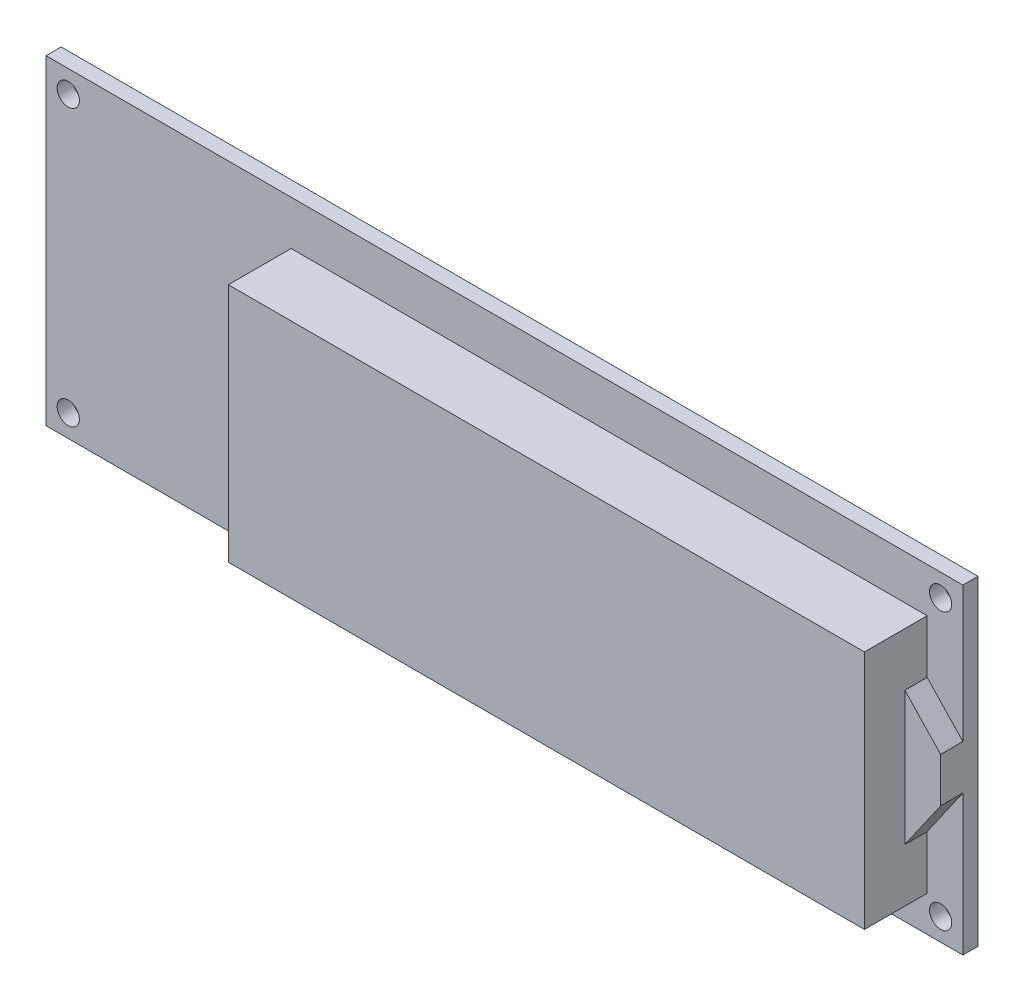
ISO-10303-21;
HEADER;
FILE_DESCRIPTION(('STEP AP214'),'2;1');
FILE_NAME('part.step','',(''),(''),'','','');
FILE_SCHEMA(('AUTOMOTIVE_DESIGN { 1 0 10303 214 1 1 1 1 }'));
ENDSEC;
DATA;
#1=APPLICATION_CONTEXT('core data for automotive mechanical design processes');
#2=APPLICATION_PROTOCOL_DEFINITION('international standard','automotive_design',2000,#1);
#3=PRODUCT_CONTEXT('',#1,'mechanical');
#4=PRODUCT('Part','Part','',(#3));
#5=PRODUCT_RELATED_PRODUCT_CATEGORY('part','',(#4));
#6=PRODUCT_DEFINITION_FORMATION('','',#4);
#7=PRODUCT_DEFINITION_CONTEXT('part definition',#1,'design');
#8=PRODUCT_DEFINITION('design','',#6,#7);
#9=PRODUCT_DEFINITION_SHAPE('','',#8);
#10=(LENGTH_UNIT() NAMED_UNIT(*) SI_UNIT(.MILLI.,.METRE.));
#11=(NAMED_UNIT(*) PLANE_ANGLE_UNIT() SI_UNIT($,.RADIAN.));
#12=(NAMED_UNIT(*) SI_UNIT($,.STERADIAN.) SOLID_ANGLE_UNIT());
#13=UNCERTAINTY_MEASURE_WITH_UNIT(LENGTH_MEASURE(1.E-05),#10,'distance_accuracy_value','');
#14=(GEOMETRIC_REPRESENTATION_CONTEXT(3) GLOBAL_UNCERTAINTY_ASSIGNED_CONTEXT((#13)) GLOBAL_UNIT_ASSIGNED_CONTEXT((#10,
#11,#12)) REPRESENTATION_CONTEXT('',''));
#15=CARTESIAN_POINT('',(0.,0.,0.));
#16=DIRECTION('',(0.,0.,1.));
#17=DIRECTION('',(1.,0.,0.));
#18=AXIS2_PLACEMENT_3D('',#15,#16,#17);
#19=CARTESIAN_POINT('',(0.,0.,1.7));
#20=DIRECTION('',(0.,0.,1.));
#21=DIRECTION('',(1.,0.,0.));
#22=AXIS2_PLACEMENT_3D('',#19,#20,#21);
#23=PLANE('',#22);
#24=CARTESIAN_POINT('',(-49.,15.5,1.7));
#25=DIRECTION('',(0.,0.,1.));
#26=DIRECTION('',(1.,0.,0.));
#27=AXIS2_PLACEMENT_3D('',#24,#25,#26);
#28=CIRCLE('',#27,1.25);
#29=CARTESIAN_POINT('',(-47.75,15.5,1.7));
#30=VERTEX_POINT('',#29);
#31=EDGE_CURVE('E171',#30,#30,#28,.T.);
#32=ORIENTED_EDGE('',*,*,#31,.F.);
#33=EDGE_LOOP('',(#32));
#34=FACE_BOUND('',#33,.T.);
#35=CARTESIAN_POINT('',(-49.,-15.5,1.7));
#36=DIRECTION('',(0.,0.,1.));
#37=DIRECTION('',(1.,0.,0.));
#38=AXIS2_PLACEMENT_3D('',#35,#36,#37);
#39=CIRCLE('',#38,1.25000000000001);
#40=CARTESIAN_POINT('',(-47.75,-15.5,1.7));
#41=VERTEX_POINT('',#40);
#42=EDGE_CURVE('E167',#41,#41,#39,.T.);
#43=ORIENTED_EDGE('',*,*,#42,.F.);
#44=EDGE_LOOP('',(#43));
#45=FACE_BOUND('',#44,.T.);
#46=CARTESIAN_POINT('',(49.,15.5,1.7));
#47=DIRECTION('',(0.,0.,1.));
#48=DIRECTION('',(1.,0.,0.));
#49=AXIS2_PLACEMENT_3D('',#46,#47,#48);
#50=CIRCLE('',#49,1.25);
#51=CARTESIAN_POINT('',(50.25,15.5,1.7));
#52=VERTEX_POINT('',#51);
#53=EDGE_CURVE('E163',#52,#52,#50,.T.);
#54=ORIENTED_EDGE('',*,*,#53,.F.);
#55=EDGE_LOOP('',(#54));
#56=FACE_BOUND('',#55,.T.);
#57=CARTESIAN_POINT('',(49.,-15.5,1.7));
#58=DIRECTION('',(0.,0.,1.));
#59=DIRECTION('',(1.,0.,0.));
#60=AXIS2_PLACEMENT_3D('',#57,#58,#59);
#61=CIRCLE('',#60,1.25);
#62=CARTESIAN_POINT('',(50.25,-15.5,1.7));
#63=VERTEX_POINT('',#62);
#64=EDGE_CURVE('E133',#63,#63,#61,.T.);
#65=ORIENTED_EDGE('',*,*,#64,.F.);
#66=EDGE_LOOP('',(#65));
#67=FACE_BOUND('',#66,.T.);
#68=DIRECTION('',(0.,1.,0.));
#69=VECTOR('',#68,1.);
#70=CARTESIAN_POINT('',(51.5,18.,1.7));
#71=LINE('',#70,#69);
#72=CARTESIAN_POINT('',(51.5,-18.,1.7));
#73=VERTEX_POINT('',#72);
#74=CARTESIAN_POINT('',(51.5,-2.2341970089883,1.7));
#75=VERTEX_POINT('',#74);
#76=EDGE_CURVE('E56',#73,#75,#71,.T.);
#77=ORIENTED_EDGE('',*,*,#76,.T.);
#78=DIRECTION('',(0.571637193839568,0.820506501265666,0.));
#79=VECTOR('',#78,1.);
#80=CARTESIAN_POINT('',(47.49,-7.99,1.7));
#81=LINE('',#80,#79);
#82=CARTESIAN_POINT('',(47.49,-7.99,1.7));
#83=VERTEX_POINT('',#82);
#84=EDGE_CURVE('E149',#83,#75,#81,.T.);
#85=ORIENTED_EDGE('',*,*,#84,.F.);
#86=DIRECTION('',(0.,1.,0.));
#87=VECTOR('',#86,1.);
#88=CARTESIAN_POINT('',(47.49,13.01,1.7));
#89=LINE('',#88,#87);
#90=CARTESIAN_POINT('',(47.49,-13.99,1.7));
#91=VERTEX_POINT('',#90);
#92=EDGE_CURVE('E131',#91,#83,#89,.T.);
#93=ORIENTED_EDGE('',*,*,#92,.F.);
#94=DIRECTION('',(1.,0.,0.));
#95=VECTOR('',#94,1.);
#96=CARTESIAN_POINT('',(-23.96,-13.99,1.7));
#97=LINE('',#96,#95);
#98=CARTESIAN_POINT('',(-23.96,-13.99,1.7));
#99=VERTEX_POINT('',#98);
#100=EDGE_CURVE('E179',#99,#91,#97,.T.);
#101=ORIENTED_EDGE('',*,*,#100,.F.);
#102=DIRECTION('',(0.,-1.,0.));
#103=VECTOR('',#102,1.);
#104=CARTESIAN_POINT('',(-23.96,13.01,1.7));
#105=LINE('',#104,#103);
#106=CARTESIAN_POINT('',(-23.96,13.01,1.7));
#107=VERTEX_POINT('',#106);
#108=EDGE_CURVE('E190',#107,#99,#105,.T.);
#109=ORIENTED_EDGE('',*,*,#108,.F.);
#110=DIRECTION('',(-1.,0.,0.));
#111=VECTOR('',#110,1.);
#112=CARTESIAN_POINT('',(-23.96,13.01,1.7));
#113=LINE('',#112,#111);
#114=CARTESIAN_POINT('',(47.49,13.01,1.7));
#115=VERTEX_POINT('',#114);
#116=EDGE_CURVE('E187',#115,#107,#113,.T.);
#117=ORIENTED_EDGE('',*,*,#116,.F.);
#118=CARTESIAN_POINT('',(47.49,7.01,1.7));
#119=VERTEX_POINT('',#118);
#120=EDGE_CURVE('E188',#119,#115,#89,.T.);
#121=ORIENTED_EDGE('',*,*,#120,.F.);
#122=DIRECTION('',(-0.687623133097345,0.726067783908218,0.));
#123=VECTOR('',#122,1.);
#124=CARTESIAN_POINT('',(47.49,7.01,1.7));
#125=LINE('',#124,#123);
#126=CARTESIAN_POINT('',(51.5,2.77580299101169,1.7));
#127=VERTEX_POINT('',#126);
#128=EDGE_CURVE('E49',#127,#119,#125,.T.);
#129=ORIENTED_EDGE('',*,*,#128,.F.);
#130=CARTESIAN_POINT('',(51.5,18.,1.7));
#131=VERTEX_POINT('',#130);
#132=EDGE_CURVE('E206',#127,#131,#71,.T.);
#133=ORIENTED_EDGE('',*,*,#132,.T.);
#134=DIRECTION('',(-1.,0.,0.));
#135=VECTOR('',#134,1.);
#136=CARTESIAN_POINT('',(-51.5,18.,1.7));
#137=LINE('',#136,#135);
#138=CARTESIAN_POINT('',(-51.5,18.,1.7));
#139=VERTEX_POINT('',#138);
#140=EDGE_CURVE('E205',#131,#139,#137,.T.);
#141=ORIENTED_EDGE('',*,*,#140,.T.);
#142=DIRECTION('',(0.,-1.,0.));
#143=VECTOR('',#142,1.);
#144=CARTESIAN_POINT('',(-51.5,18.,1.7));
#145=LINE('',#144,#143);
#146=CARTESIAN_POINT('',(-51.5,-18.,1.7));
#147=VERTEX_POINT('',#146);
#148=EDGE_CURVE('E208',#139,#147,#145,.T.);
#149=ORIENTED_EDGE('',*,*,#148,.T.);
#150=DIRECTION('',(1.,0.,0.));
#151=VECTOR('',#150,1.);
#152=CARTESIAN_POINT('',(-51.5,-18.,1.7));
#153=LINE('',#152,#151);
#154=EDGE_CURVE('E210',#147,#73,#153,.T.);
#155=ORIENTED_EDGE('',*,*,#154,.T.);
#156=EDGE_LOOP('',(#77,#85,#93,#101,#109,#117,#121,#129,#133,#141,#149,#155));
#157=FACE_BOUND('',#156,.T.);
#158=ADVANCED_FACE('F32',(#34,#45,#56,#67,#157),#23,.T.);
#159=CARTESIAN_POINT('',(47.49,13.01,8.75));
#160=DIRECTION('',(-1.,0.,0.));
#161=DIRECTION('',(0.,0.,1.));
#162=AXIS2_PLACEMENT_3D('',#159,#160,#161);
#163=PLANE('',#162);
#164=DIRECTION('',(0.,0.,-1.));
#165=VECTOR('',#164,1.);
#166=CARTESIAN_POINT('',(47.49,-7.99,4.2));
#167=LINE('',#166,#165);
#168=CARTESIAN_POINT('',(47.49,-7.99,4.2));
#169=VERTEX_POINT('',#168);
#170=EDGE_CURVE('E123',#169,#83,#167,.T.);
#171=ORIENTED_EDGE('',*,*,#170,.F.);
#172=DIRECTION('',(0.,-1.,0.));
#173=VECTOR('',#172,1.);
#174=CARTESIAN_POINT('',(47.49,-7.99,4.2));
#175=LINE('',#174,#173);
#176=CARTESIAN_POINT('',(47.49,7.01,4.2));
#177=VERTEX_POINT('',#176);
#178=EDGE_CURVE('E127',#177,#169,#175,.T.);
#179=ORIENTED_EDGE('',*,*,#178,.F.);
#180=DIRECTION('',(0.,0.,-1.));
#181=VECTOR('',#180,1.);
#182=CARTESIAN_POINT('',(47.49,7.01,4.2));
#183=LINE('',#182,#181);
#184=EDGE_CURVE('E154',#177,#119,#183,.T.);
#185=ORIENTED_EDGE('',*,*,#184,.T.);
#186=ORIENTED_EDGE('',*,*,#120,.T.);
#187=DIRECTION('',(0.,0.,-1.));
#188=VECTOR('',#187,1.);
#189=CARTESIAN_POINT('',(47.49,13.01,8.75));
#190=LINE('',#189,#188);
#191=CARTESIAN_POINT('',(47.49,13.01,8.75));
#192=VERTEX_POINT('',#191);
#193=EDGE_CURVE('E200',#192,#115,#190,.T.);
#194=ORIENTED_EDGE('',*,*,#193,.F.);
#195=DIRECTION('',(0.,1.,0.));
#196=VECTOR('',#195,1.);
#197=CARTESIAN_POINT('',(47.49,13.01,8.75));
#198=LINE('',#197,#196);
#199=CARTESIAN_POINT('',(47.49,-13.99,8.75));
#200=VERTEX_POINT('',#199);
#201=EDGE_CURVE('E175',#200,#192,#198,.T.);
#202=ORIENTED_EDGE('',*,*,#201,.F.);
#203=DIRECTION('',(0.,0.,-1.));
#204=VECTOR('',#203,1.);
#205=CARTESIAN_POINT('',(47.49,-13.99,8.75));
#206=LINE('',#205,#204);
#207=EDGE_CURVE('E185',#200,#91,#206,.T.);
#208=ORIENTED_EDGE('',*,*,#207,.T.);
#209=ORIENTED_EDGE('',*,*,#92,.T.);
#210=EDGE_LOOP('',(#171,#179,#185,#186,#194,#202,#208,#209));
#211=FACE_BOUND('',#210,.T.);
#212=ADVANCED_FACE('F125',(#211),#163,.F.);
#213=CARTESIAN_POINT('',(51.5,18.,1.7));
#214=DIRECTION('',(-1.,0.,0.));
#215=DIRECTION('',(0.,-1.,0.));
#216=AXIS2_PLACEMENT_3D('',#213,#214,#215);
#217=PLANE('',#216);
#218=DIRECTION('',(0.,1.,0.));
#219=VECTOR('',#218,1.);
#220=CARTESIAN_POINT('',(51.5,18.,0.));
#221=LINE('',#220,#219);
#222=CARTESIAN_POINT('',(51.5,-18.,0.));
#223=VERTEX_POINT('',#222);
#224=CARTESIAN_POINT('',(51.5,18.,0.));
#225=VERTEX_POINT('',#224);
#226=EDGE_CURVE('E203',#223,#225,#221,.T.);
#227=ORIENTED_EDGE('',*,*,#226,.T.);
#228=DIRECTION('',(0.,0.,-1.));
#229=VECTOR('',#228,1.);
#230=CARTESIAN_POINT('',(51.5,18.,1.7));
#231=LINE('',#230,#229);
#232=EDGE_CURVE('E11',#131,#225,#231,.T.);
#233=ORIENTED_EDGE('',*,*,#232,.F.);
#234=ORIENTED_EDGE('',*,*,#132,.F.);
#235=DIRECTION('',(0.,0.,-1.));
#236=VECTOR('',#235,1.);
#237=CARTESIAN_POINT('',(51.5,2.7758029910117,4.2));
#238=LINE('',#237,#236);
#239=CARTESIAN_POINT('',(51.5,2.7758029910117,4.2));
#240=VERTEX_POINT('',#239);
#241=EDGE_CURVE('E157',#240,#127,#238,.T.);
#242=ORIENTED_EDGE('',*,*,#241,.F.);
#243=DIRECTION('',(0.,1.,0.));
#244=VECTOR('',#243,1.);
#245=CARTESIAN_POINT('',(51.5,-2.2341970089883,4.2));
#246=LINE('',#245,#244);
#247=CARTESIAN_POINT('',(51.5,-2.2341970089883,4.2));
#248=VERTEX_POINT('',#247);
#249=EDGE_CURVE('E142',#248,#240,#246,.T.);
#250=ORIENTED_EDGE('',*,*,#249,.F.);
#251=DIRECTION('',(0.,0.,-1.));
#252=VECTOR('',#251,1.);
#253=CARTESIAN_POINT('',(51.5,-2.2341970089883,4.2));
#254=LINE('',#253,#252);
#255=EDGE_CURVE('E134',#248,#75,#254,.T.);
#256=ORIENTED_EDGE('',*,*,#255,.T.);
#257=ORIENTED_EDGE('',*,*,#76,.F.);
#258=DIRECTION('',(0.,0.,-1.));
#259=VECTOR('',#258,1.);
#260=CARTESIAN_POINT('',(51.5,-18.,1.7));
#261=LINE('',#260,#259);
#262=EDGE_CURVE('E212',#73,#223,#261,.T.);
#263=ORIENTED_EDGE('',*,*,#262,.T.);
#264=EDGE_LOOP('',(#227,#233,#234,#242,#250,#256,#257,#263));
#265=FACE_BOUND('',#264,.T.);
#266=ADVANCED_FACE('F34',(#265),#217,.F.);
#267=CARTESIAN_POINT('',(-51.5,18.,1.7));
#268=DIRECTION('',(0.,-1.,0.));
#269=DIRECTION('',(0.,0.,-1.));
#270=AXIS2_PLACEMENT_3D('',#267,#268,#269);
#271=PLANE('',#270);
#272=DIRECTION('',(-1.,0.,0.));
#273=VECTOR('',#272,1.);
#274=CARTESIAN_POINT('',(-51.5,18.,0.));
#275=LINE('',#274,#273);
#276=CARTESIAN_POINT('',(-51.5,18.,0.));
#277=VERTEX_POINT('',#276);
#278=EDGE_CURVE('E215',#225,#277,#275,.T.);
#279=ORIENTED_EDGE('',*,*,#278,.T.);
#280=DIRECTION('',(0.,0.,-1.));
#281=VECTOR('',#280,1.);
#282=CARTESIAN_POINT('',(-51.5,18.,1.7));
#283=LINE('',#282,#281);
#284=EDGE_CURVE('E41',#139,#277,#283,.T.);
#285=ORIENTED_EDGE('',*,*,#284,.F.);
#286=ORIENTED_EDGE('',*,*,#140,.F.);
#287=ORIENTED_EDGE('',*,*,#232,.T.);
#288=EDGE_LOOP('',(#279,#285,#286,#287));
#289=FACE_BOUND('',#288,.T.);
#290=ADVANCED_FACE('F273',(#289),#271,.F.);
#291=CARTESIAN_POINT('',(-51.5,18.,1.7));
#292=DIRECTION('',(1.,0.,0.));
#293=DIRECTION('',(0.,1.,0.));
#294=AXIS2_PLACEMENT_3D('',#291,#292,#293);
#295=PLANE('',#294);
#296=DIRECTION('',(0.,-1.,0.));
#297=VECTOR('',#296,1.);
#298=CARTESIAN_POINT('',(-51.5,18.,0.));
#299=LINE('',#298,#297);
#300=CARTESIAN_POINT('',(-51.5,-18.,0.));
#301=VERTEX_POINT('',#300);
#302=EDGE_CURVE('E217',#277,#301,#299,.T.);
#303=ORIENTED_EDGE('',*,*,#302,.T.);
#304=DIRECTION('',(0.,0.,-1.));
#305=VECTOR('',#304,1.);
#306=CARTESIAN_POINT('',(-51.5,-18.,1.7));
#307=LINE('',#306,#305);
#308=EDGE_CURVE('E223',#147,#301,#307,.T.);
#309=ORIENTED_EDGE('',*,*,#308,.F.);
#310=ORIENTED_EDGE('',*,*,#148,.F.);
#311=ORIENTED_EDGE('',*,*,#284,.T.);
#312=EDGE_LOOP('',(#303,#309,#310,#311));
#313=FACE_BOUND('',#312,.T.);
#314=ADVANCED_FACE('F270',(#313),#295,.F.);
#315=CARTESIAN_POINT('',(-51.5,-18.,1.7));
#316=DIRECTION('',(0.,1.,0.));
#317=DIRECTION('',(0.,0.,1.));
#318=AXIS2_PLACEMENT_3D('',#315,#316,#317);
#319=PLANE('',#318);
#320=DIRECTION('',(1.,0.,0.));
#321=VECTOR('',#320,1.);
#322=CARTESIAN_POINT('',(-51.5,-18.,0.));
#323=LINE('',#322,#321);
#324=EDGE_CURVE('E219',#301,#223,#323,.T.);
#325=ORIENTED_EDGE('',*,*,#324,.T.);
#326=ORIENTED_EDGE('',*,*,#262,.F.);
#327=ORIENTED_EDGE('',*,*,#154,.F.);
#328=ORIENTED_EDGE('',*,*,#308,.T.);
#329=EDGE_LOOP('',(#325,#326,#327,#328));
#330=FACE_BOUND('',#329,.T.);
#331=ADVANCED_FACE('F266',(#330),#319,.F.);
#332=CARTESIAN_POINT('',(0.,0.,0.));
#333=DIRECTION('',(0.,0.,1.));
#334=DIRECTION('',(1.,0.,0.));
#335=AXIS2_PLACEMENT_3D('',#332,#333,#334);
#336=PLANE('',#335);
#337=CARTESIAN_POINT('',(49.,-15.5,0.));
#338=DIRECTION('',(0.,0.,1.));
#339=DIRECTION('',(1.,0.,0.));
#340=AXIS2_PLACEMENT_3D('',#337,#338,#339);
#341=CIRCLE('',#340,1.25);
#342=CARTESIAN_POINT('',(50.25,-15.5,0.));
#343=VERTEX_POINT('',#342);
#344=EDGE_CURVE('E36',#343,#343,#341,.T.);
#345=ORIENTED_EDGE('',*,*,#344,.T.);
#346=EDGE_LOOP('',(#345));
#347=FACE_BOUND('',#346,.T.);
#348=CARTESIAN_POINT('',(49.,15.5,0.));
#349=DIRECTION('',(0.,0.,1.));
#350=DIRECTION('',(1.,0.,0.));
#351=AXIS2_PLACEMENT_3D('',#348,#349,#350);
#352=CIRCLE('',#351,1.25);
#353=CARTESIAN_POINT('',(50.25,15.5,0.));
#354=VERTEX_POINT('',#353);
#355=EDGE_CURVE('E166',#354,#354,#352,.T.);
#356=ORIENTED_EDGE('',*,*,#355,.T.);
#357=EDGE_LOOP('',(#356));
#358=FACE_BOUND('',#357,.T.);
#359=CARTESIAN_POINT('',(-49.,-15.5,0.));
#360=DIRECTION('',(0.,0.,1.));
#361=DIRECTION('',(1.,0.,0.));
#362=AXIS2_PLACEMENT_3D('',#359,#360,#361);
#363=CIRCLE('',#362,1.25000000000001);
#364=CARTESIAN_POINT('',(-47.75,-15.5,0.));
#365=VERTEX_POINT('',#364);
#366=EDGE_CURVE('E170',#365,#365,#363,.T.);
#367=ORIENTED_EDGE('',*,*,#366,.T.);
#368=EDGE_LOOP('',(#367));
#369=FACE_BOUND('',#368,.T.);
#370=CARTESIAN_POINT('',(-49.,15.5,0.));
#371=DIRECTION('',(0.,0.,1.));
#372=DIRECTION('',(1.,0.,0.));
#373=AXIS2_PLACEMENT_3D('',#370,#371,#372);
#374=CIRCLE('',#373,1.25);
#375=CARTESIAN_POINT('',(-47.75,15.5,0.));
#376=VERTEX_POINT('',#375);
#377=EDGE_CURVE('E174',#376,#376,#374,.T.);
#378=ORIENTED_EDGE('',*,*,#377,.T.);
#379=EDGE_LOOP('',(#378));
#380=FACE_BOUND('',#379,.T.);
#381=ORIENTED_EDGE('',*,*,#226,.F.);
#382=ORIENTED_EDGE('',*,*,#324,.F.);
#383=ORIENTED_EDGE('',*,*,#302,.F.);
#384=ORIENTED_EDGE('',*,*,#278,.F.);
#385=EDGE_LOOP('',(#381,#382,#383,#384));
#386=FACE_BOUND('',#385,.T.);
#387=ADVANCED_FACE('F234',(#347,#358,#369,#380,#386),#336,.F.);
#388=CARTESIAN_POINT('',(-23.96,13.01,8.75));
#389=DIRECTION('',(0.,-1.,0.));
#390=DIRECTION('',(1.,0.,0.));
#391=AXIS2_PLACEMENT_3D('',#388,#389,#390);
#392=PLANE('',#391);
#393=ORIENTED_EDGE('',*,*,#116,.T.);
#394=DIRECTION('',(0.,0.,-1.));
#395=VECTOR('',#394,1.);
#396=CARTESIAN_POINT('',(-23.96,13.01,8.75));
#397=LINE('',#396,#395);
#398=CARTESIAN_POINT('',(-23.96,13.01,8.75));
#399=VERTEX_POINT('',#398);
#400=EDGE_CURVE('E197',#399,#107,#397,.T.);
#401=ORIENTED_EDGE('',*,*,#400,.F.);
#402=DIRECTION('',(-1.,0.,0.));
#403=VECTOR('',#402,1.);
#404=CARTESIAN_POINT('',(-23.96,13.01,8.75));
#405=LINE('',#404,#403);
#406=EDGE_CURVE('E178',#192,#399,#405,.T.);
#407=ORIENTED_EDGE('',*,*,#406,.F.);
#408=ORIENTED_EDGE('',*,*,#193,.T.);
#409=EDGE_LOOP('',(#393,#401,#407,#408));
#410=FACE_BOUND('',#409,.T.);
#411=ADVANCED_FACE('F265',(#410),#392,.F.);
#412=CARTESIAN_POINT('',(-23.96,13.01,8.75));
#413=DIRECTION('',(1.,0.,0.));
#414=DIRECTION('',(0.,0.,-1.));
#415=AXIS2_PLACEMENT_3D('',#412,#413,#414);
#416=PLANE('',#415);
#417=ORIENTED_EDGE('',*,*,#108,.T.);
#418=DIRECTION('',(0.,0.,-1.));
#419=VECTOR('',#418,1.);
#420=CARTESIAN_POINT('',(-23.96,-13.99,8.75));
#421=LINE('',#420,#419);
#422=CARTESIAN_POINT('',(-23.96,-13.99,8.75));
#423=VERTEX_POINT('',#422);
#424=EDGE_CURVE('E195',#423,#99,#421,.T.);
#425=ORIENTED_EDGE('',*,*,#424,.F.);
#426=DIRECTION('',(0.,-1.,0.));
#427=VECTOR('',#426,1.);
#428=CARTESIAN_POINT('',(-23.96,13.01,8.75));
#429=LINE('',#428,#427);
#430=EDGE_CURVE('E181',#399,#423,#429,.T.);
#431=ORIENTED_EDGE('',*,*,#430,.F.);
#432=ORIENTED_EDGE('',*,*,#400,.T.);
#433=EDGE_LOOP('',(#417,#425,#431,#432));
#434=FACE_BOUND('',#433,.T.);
#435=ADVANCED_FACE('F303',(#434),#416,.F.);
#436=CARTESIAN_POINT('',(-23.96,-13.99,8.75));
#437=DIRECTION('',(0.,1.,0.));
#438=DIRECTION('',(0.,0.,1.));
#439=AXIS2_PLACEMENT_3D('',#436,#437,#438);
#440=PLANE('',#439);
#441=ORIENTED_EDGE('',*,*,#100,.T.);
#442=ORIENTED_EDGE('',*,*,#207,.F.);
#443=DIRECTION('',(1.,0.,0.));
#444=VECTOR('',#443,1.);
#445=CARTESIAN_POINT('',(-23.96,-13.99,8.75));
#446=LINE('',#445,#444);
#447=EDGE_CURVE('E183',#423,#200,#446,.T.);
#448=ORIENTED_EDGE('',*,*,#447,.F.);
#449=ORIENTED_EDGE('',*,*,#424,.T.);
#450=EDGE_LOOP('',(#441,#442,#448,#449));
#451=FACE_BOUND('',#450,.T.);
#452=ADVANCED_FACE('F311',(#451),#440,.F.);
#453=CARTESIAN_POINT('',(0.,0.,8.75));
#454=DIRECTION('',(0.,0.,1.));
#455=DIRECTION('',(1.,0.,0.));
#456=AXIS2_PLACEMENT_3D('',#453,#454,#455);
#457=PLANE('',#456);
#458=ORIENTED_EDGE('',*,*,#201,.T.);
#459=ORIENTED_EDGE('',*,*,#406,.T.);
#460=ORIENTED_EDGE('',*,*,#430,.T.);
#461=ORIENTED_EDGE('',*,*,#447,.T.);
#462=EDGE_LOOP('',(#458,#459,#460,#461));
#463=FACE_BOUND('',#462,.T.);
#464=ADVANCED_FACE('F307',(#463),#457,.T.);
#465=CARTESIAN_POINT('',(-49.,15.5,-4.3));
#466=DIRECTION('',(0.,0.,1.));
#467=DIRECTION('',(1.,0.,0.));
#468=AXIS2_PLACEMENT_3D('',#465,#466,#467);
#469=CYLINDRICAL_SURFACE('',#468,1.25);
#470=ORIENTED_EDGE('',*,*,#31,.T.);
#471=EDGE_LOOP('',(#470));
#472=FACE_BOUND('',#471,.T.);
#473=ORIENTED_EDGE('',*,*,#377,.F.);
#474=EDGE_LOOP('',(#473));
#475=FACE_BOUND('',#474,.T.);
#476=ADVANCED_FACE('F249',(#472,#475),#469,.F.);
#477=CARTESIAN_POINT('',(-49.,-15.5,-4.3));
#478=DIRECTION('',(0.,0.,1.));
#479=DIRECTION('',(1.,0.,0.));
#480=AXIS2_PLACEMENT_3D('',#477,#478,#479);
#481=CYLINDRICAL_SURFACE('',#480,1.25000000000001);
#482=ORIENTED_EDGE('',*,*,#42,.T.);
#483=EDGE_LOOP('',(#482));
#484=FACE_BOUND('',#483,.T.);
#485=ORIENTED_EDGE('',*,*,#366,.F.);
#486=EDGE_LOOP('',(#485));
#487=FACE_BOUND('',#486,.T.);
#488=ADVANCED_FACE('F240',(#484,#487),#481,.F.);
#489=CARTESIAN_POINT('',(49.,15.5,-4.3));
#490=DIRECTION('',(0.,0.,1.));
#491=DIRECTION('',(1.,0.,0.));
#492=AXIS2_PLACEMENT_3D('',#489,#490,#491);
#493=CYLINDRICAL_SURFACE('',#492,1.25);
#494=ORIENTED_EDGE('',*,*,#53,.T.);
#495=EDGE_LOOP('',(#494));
#496=FACE_BOUND('',#495,.T.);
#497=ORIENTED_EDGE('',*,*,#355,.F.);
#498=EDGE_LOOP('',(#497));
#499=FACE_BOUND('',#498,.T.);
#500=ADVANCED_FACE('F237',(#496,#499),#493,.F.);
#501=CARTESIAN_POINT('',(49.,-15.5,-4.3));
#502=DIRECTION('',(0.,0.,1.));
#503=DIRECTION('',(1.,0.,0.));
#504=AXIS2_PLACEMENT_3D('',#501,#502,#503);
#505=CYLINDRICAL_SURFACE('',#504,1.25);
#506=ORIENTED_EDGE('',*,*,#64,.T.);
#507=EDGE_LOOP('',(#506));
#508=FACE_BOUND('',#507,.T.);
#509=ORIENTED_EDGE('',*,*,#344,.F.);
#510=EDGE_LOOP('',(#509));
#511=FACE_BOUND('',#510,.T.);
#512=ADVANCED_FACE('F239',(#508,#511),#505,.F.);
#513=CARTESIAN_POINT('',(47.49,-7.99,4.2));
#514=DIRECTION('',(-0.820506501265666,0.571637193839568,0.));
#515=DIRECTION('',(-0.571637193839568,-0.820506501265666,0.));
#516=AXIS2_PLACEMENT_3D('',#513,#514,#515);
#517=PLANE('',#516);
#518=ORIENTED_EDGE('',*,*,#84,.T.);
#519=ORIENTED_EDGE('',*,*,#255,.F.);
#520=DIRECTION('',(0.571637193839568,0.820506501265666,0.));
#521=VECTOR('',#520,1.);
#522=CARTESIAN_POINT('',(47.49,-7.99,4.2));
#523=LINE('',#522,#521);
#524=EDGE_CURVE('E137',#169,#248,#523,.T.);
#525=ORIENTED_EDGE('',*,*,#524,.F.);
#526=ORIENTED_EDGE('',*,*,#170,.T.);
#527=EDGE_LOOP('',(#518,#519,#525,#526));
#528=FACE_BOUND('',#527,.T.);
#529=ADVANCED_FACE('F138',(#528),#517,.F.);
#530=CARTESIAN_POINT('',(47.49,7.01,4.2));
#531=DIRECTION('',(-0.726067783908218,-0.687623133097345,0.));
#532=DIRECTION('',(0.687623133097345,-0.726067783908218,0.));
#533=AXIS2_PLACEMENT_3D('',#530,#531,#532);
#534=PLANE('',#533);
#535=ORIENTED_EDGE('',*,*,#128,.T.);
#536=ORIENTED_EDGE('',*,*,#184,.F.);
#537=DIRECTION('',(-0.687623133097345,0.726067783908218,0.));
#538=VECTOR('',#537,1.);
#539=CARTESIAN_POINT('',(47.49,7.01,4.2));
#540=LINE('',#539,#538);
#541=EDGE_CURVE('E146',#240,#177,#540,.T.);
#542=ORIENTED_EDGE('',*,*,#541,.F.);
#543=ORIENTED_EDGE('',*,*,#241,.T.);
#544=EDGE_LOOP('',(#535,#536,#542,#543));
#545=FACE_BOUND('',#544,.T.);
#546=ADVANCED_FACE('F294',(#545),#534,.F.);
#547=CARTESIAN_POINT('',(0.,0.,4.2));
#548=DIRECTION('',(0.,0.,-1.));
#549=DIRECTION('',(-1.,0.,0.));
#550=AXIS2_PLACEMENT_3D('',#547,#548,#549);
#551=PLANE('',#550);
#552=ORIENTED_EDGE('',*,*,#178,.T.);
#553=ORIENTED_EDGE('',*,*,#524,.T.);
#554=ORIENTED_EDGE('',*,*,#249,.T.);
#555=ORIENTED_EDGE('',*,*,#541,.T.);
#556=EDGE_LOOP('',(#552,#553,#554,#555));
#557=FACE_BOUND('',#556,.T.);
#558=ADVANCED_FACE('F144',(#557),#551,.F.);
#559=CLOSED_SHELL('',(#158,#212,#266,#290,#314,#331,#387,#411,#435,#452,#464,#476,#488,#500,
#512,#529,#546,#558));
#560=MANIFOLD_SOLID_BREP('B2',#559);
#561=ADVANCED_BREP_SHAPE_REPRESENTATION('',(#18,#560),#14);
#562=SHAPE_DEFINITION_REPRESENTATION(#9,#561);
ENDSEC;
END-ISO-10303-21;
